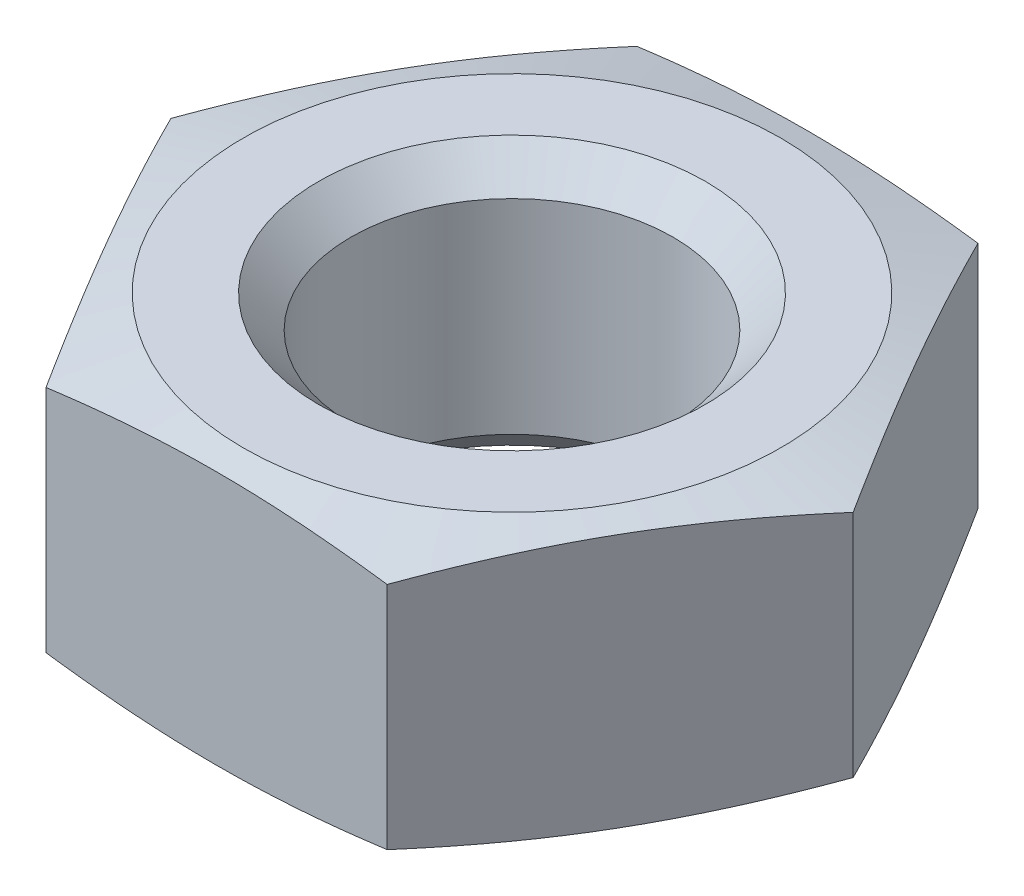
ISO-10303-21;
HEADER;
FILE_DESCRIPTION(('STEP AP214'),'2;1');
FILE_NAME('part.step','',(''),(''),'','','');
FILE_SCHEMA(('AUTOMOTIVE_DESIGN { 1 0 10303 214 1 1 1 1 }'));
ENDSEC;
DATA;
#1=APPLICATION_CONTEXT('core data for automotive mechanical design processes');
#2=APPLICATION_PROTOCOL_DEFINITION('international standard','automotive_design',2000,#1);
#3=PRODUCT_CONTEXT('',#1,'mechanical');
#4=PRODUCT('Part','Part','',(#3));
#5=PRODUCT_RELATED_PRODUCT_CATEGORY('part','',(#4));
#6=PRODUCT_DEFINITION_FORMATION('','',#4);
#7=PRODUCT_DEFINITION_CONTEXT('part definition',#1,'design');
#8=PRODUCT_DEFINITION('design','',#6,#7);
#9=PRODUCT_DEFINITION_SHAPE('','',#8);
#10=(LENGTH_UNIT() NAMED_UNIT(*) SI_UNIT(.MILLI.,.METRE.));
#11=(NAMED_UNIT(*) PLANE_ANGLE_UNIT() SI_UNIT($,.RADIAN.));
#12=(NAMED_UNIT(*) SI_UNIT($,.STERADIAN.) SOLID_ANGLE_UNIT());
#13=UNCERTAINTY_MEASURE_WITH_UNIT(LENGTH_MEASURE(1.E-05),#10,'distance_accuracy_value','');
#14=(GEOMETRIC_REPRESENTATION_CONTEXT(3) GLOBAL_UNCERTAINTY_ASSIGNED_CONTEXT((#13)) GLOBAL_UNIT_ASSIGNED_CONTEXT((#10,
#11,#12)) REPRESENTATION_CONTEXT('',''));
#15=CARTESIAN_POINT('',(0.,0.,0.));
#16=DIRECTION('',(0.,0.,1.));
#17=DIRECTION('',(1.,0.,0.));
#18=AXIS2_PLACEMENT_3D('',#15,#16,#17);
#19=CARTESIAN_POINT('',(-4.7631397208144,2.5,-2.75));
#20=DIRECTION('',(0.,-1.,0.));
#21=DIRECTION('',(0.,0.,-1.));
#22=AXIS2_PLACEMENT_3D('',#19,#20,#21);
#23=PLANE('',#22);
#24=CARTESIAN_POINT('',(0.,2.5,0.));
#25=DIRECTION('',(0.,-1.,0.));
#26=DIRECTION('',(0.,0.,-1.));
#27=AXIS2_PLACEMENT_3D('',#24,#25,#26);
#28=CIRCLE('',#27,2.5);
#29=CARTESIAN_POINT('',(0.,2.5,-2.5));
#30=VERTEX_POINT('',#29);
#31=EDGE_CURVE('E103',#30,#30,#28,.T.);
#32=ORIENTED_EDGE('',*,*,#31,.F.);
#33=EDGE_LOOP('',(#32));
#34=FACE_BOUND('',#33,.T.);
#35=CARTESIAN_POINT('',(0.,2.5,0.));
#36=DIRECTION('',(0.,-1.,0.));
#37=DIRECTION('',(0.,0.,-1.));
#38=AXIS2_PLACEMENT_3D('',#35,#36,#37);
#39=CIRCLE('',#38,1.8);
#40=CARTESIAN_POINT('',(0.,2.5,-1.8));
#41=VERTEX_POINT('',#40);
#42=EDGE_CURVE('E209',#41,#41,#39,.T.);
#43=ORIENTED_EDGE('',*,*,#42,.T.);
#44=EDGE_LOOP('',(#43));
#45=FACE_BOUND('',#44,.T.);
#46=ADVANCED_FACE('F30',(#34,#45),#23,.F.);
#47=CARTESIAN_POINT('',(-4.7631397208144,0.,-2.75));
#48=DIRECTION('',(0.,-1.,0.));
#49=DIRECTION('',(0.,0.,-1.));
#50=AXIS2_PLACEMENT_3D('',#47,#48,#49);
#51=PLANE('',#50);
#52=CARTESIAN_POINT('',(0.,0.,0.));
#53=DIRECTION('',(0.,-1.,0.));
#54=DIRECTION('',(0.,0.,-1.));
#55=AXIS2_PLACEMENT_3D('',#52,#53,#54);
#56=CIRCLE('',#55,2.5);
#57=CARTESIAN_POINT('',(0.,0.,-2.5));
#58=VERTEX_POINT('',#57);
#59=EDGE_CURVE('E191',#58,#58,#56,.T.);
#60=ORIENTED_EDGE('',*,*,#59,.T.);
#61=EDGE_LOOP('',(#60));
#62=FACE_BOUND('',#61,.T.);
#63=CARTESIAN_POINT('',(0.,0.,0.));
#64=DIRECTION('',(0.,-1.,0.));
#65=DIRECTION('',(0.,0.,-1.));
#66=AXIS2_PLACEMENT_3D('',#63,#64,#65);
#67=CIRCLE('',#66,1.8);
#68=CARTESIAN_POINT('',(0.,0.,-1.8));
#69=VERTEX_POINT('',#68);
#70=EDGE_CURVE('E203',#69,#69,#67,.T.);
#71=ORIENTED_EDGE('',*,*,#70,.F.);
#72=EDGE_LOOP('',(#71));
#73=FACE_BOUND('',#72,.T.);
#74=ADVANCED_FACE('F232',(#62,#73),#51,.T.);
#75=CARTESIAN_POINT('',(-1.58771324027146,2.5,2.75));
#76=DIRECTION('',(0.866025403784439,0.,-0.5));
#77=DIRECTION('',(-0.5,0.,-0.866025403784439));
#78=AXIS2_PLACEMENT_3D('',#75,#76,#77);
#79=PLANE('',#78);
#80=DIRECTION('',(0.,-1.,0.));
#81=VECTOR('',#80,1.);
#82=CARTESIAN_POINT('',(-1.58771324027146,2.5,2.75));
#83=LINE('',#82,#81);
#84=CARTESIAN_POINT('',(-1.58771324027149,2.31902001999193,2.75));
#85=VERTEX_POINT('',#84);
#86=CARTESIAN_POINT('',(-1.58771324027149,0.180979980008075,2.75));
#87=VERTEX_POINT('',#86);
#88=EDGE_CURVE('E117',#85,#87,#83,.T.);
#89=ORIENTED_EDGE('',*,*,#88,.F.);
#90=CARTESIAN_POINT('',(-1.58759777021762,2.31898907819667,2.7502));
#91=CARTESIAN_POINT('',(-1.65354106989093,2.33666714095726,2.63598285454709));
#92=CARTESIAN_POINT('',(-1.71960394358881,2.35271599027166,2.52155860080835));
#93=CARTESIAN_POINT('',(-1.85196302987708,2.38091241674241,2.29230593851367));
#94=CARTESIAN_POINT('',(-1.91825932624663,2.39305840879363,2.17747738484797));
#95=CARTESIAN_POINT('',(-2.05068324435206,2.41273995364582,1.94811243055202));
#96=CARTESIAN_POINT('',(-2.1168099703633,2.42029898080924,1.83357758136237));
#97=CARTESIAN_POINT('',(-2.24914776358957,2.43043487281712,1.60436179973292));
#98=CARTESIAN_POINT('',(-2.31535881199838,2.43301270189222,1.48968089986646));
#99=CARTESIAN_POINT('',(-2.447780908816,2.43301270189222,1.26031910013354));
#100=CARTESIAN_POINT('',(-2.51399195722481,2.43043487281712,1.14563820026708));
#101=CARTESIAN_POINT('',(-2.64632975045108,2.42029898080924,0.916422418637631));
#102=CARTESIAN_POINT('',(-2.71245647646232,2.41273995364582,0.801887569447985));
#103=CARTESIAN_POINT('',(-2.84488039456775,2.39305840879363,0.572522615152036));
#104=CARTESIAN_POINT('',(-2.9111766909373,2.38091241674242,0.457694061486333));
#105=CARTESIAN_POINT('',(-3.04353577722557,2.35271599027166,0.228441399191655));
#106=CARTESIAN_POINT('',(-3.10959865092346,2.33666714095727,0.114017145452912));
#107=CARTESIAN_POINT('',(-3.17554195059676,2.31898907819668,-0.000200000000000115));
#108=B_SPLINE_CURVE_WITH_KNOTS('',3,(#90,#91,#92,#93,#94,#95,#96,#97,#98,#99,#100,#101,#102,
#103,#104,#105,#106,#107),.UNSPECIFIED.,.F.,.F.,(4,2,2,2,2,2,2,2,4),(0.,0.399219246203696,
0.798600426844827,1.19592009799431,1.59316285066086,1.99040560332741,2.38772527447689,
2.78710645511802,3.18632570132172),.UNSPECIFIED.);
#109=CARTESIAN_POINT('',(-3.17542648054295,2.31902001999193,0.));
#110=VERTEX_POINT('',#109);
#111=EDGE_CURVE('E184',#85,#110,#108,.T.);
#112=ORIENTED_EDGE('',*,*,#111,.T.);
#113=DIRECTION('',(0.,-1.,0.));
#114=VECTOR('',#113,1.);
#115=CARTESIAN_POINT('',(-3.17542648054293,2.5,0.));
#116=LINE('',#115,#114);
#117=CARTESIAN_POINT('',(-3.17542648054293,0.180979980008068,0.));
#118=VERTEX_POINT('',#117);
#119=EDGE_CURVE('E58',#110,#118,#116,.T.);
#120=ORIENTED_EDGE('',*,*,#119,.T.);
#121=CARTESIAN_POINT('',(-3.17554195059676,0.181010921803324,-0.0002));
#122=CARTESIAN_POINT('',(-3.10959865092346,0.163332859042733,0.114017145452912));
#123=CARTESIAN_POINT('',(-3.04353577722557,0.147284009728339,0.228441399191655));
#124=CARTESIAN_POINT('',(-2.9111766909373,0.119087583257584,0.457694061486332));
#125=CARTESIAN_POINT('',(-2.84488039456775,0.106941591206373,0.572522615152036));
#126=CARTESIAN_POINT('',(-2.71245647646232,0.0872600463541762,0.801887569447985));
#127=CARTESIAN_POINT('',(-2.64632975045108,0.079701019190757,0.916422418637631));
#128=CARTESIAN_POINT('',(-2.51399195722481,0.0695651271828838,1.14563820026708));
#129=CARTESIAN_POINT('',(-2.447780908816,0.0669872981077755,1.26031910013354));
#130=CARTESIAN_POINT('',(-2.31535881199838,0.0669872981077757,1.48968089986646));
#131=CARTESIAN_POINT('',(-2.24914776358957,0.0695651271828842,1.60436179973292));
#132=CARTESIAN_POINT('',(-2.1168099703633,0.0797010191907579,1.83357758136237));
#133=CARTESIAN_POINT('',(-2.05068324435207,0.0872600463541773,1.94811243055202));
#134=CARTESIAN_POINT('',(-1.91825932624663,0.106941591206374,2.17747738484797));
#135=CARTESIAN_POINT('',(-1.85196302987708,0.119087583257586,2.29230593851367));
#136=CARTESIAN_POINT('',(-1.71960394358881,0.147284009728341,2.52155860080835));
#137=CARTESIAN_POINT('',(-1.65354106989093,0.163332859042736,2.63598285454709));
#138=CARTESIAN_POINT('',(-1.58759777021762,0.181010921803327,2.7502));
#139=B_SPLINE_CURVE_WITH_KNOTS('',3,(#121,#122,#123,#124,#125,#126,#127,#128,#129,#130,#131,
#132,#133,#134,#135,#136,#137,#138),.UNSPECIFIED.,.F.,.F.,(4,2,2,2,2,2,2,2,4),(0.,
0.399219246203695,0.798600426844827,1.19592009799431,1.59316285066086,1.99040560332741,
2.38772527447689,2.78710645511802,3.18632570132172),.UNSPECIFIED.);
#140=EDGE_CURVE('E164',#118,#87,#139,.T.);
#141=ORIENTED_EDGE('',*,*,#140,.T.);
#142=EDGE_LOOP('',(#89,#112,#120,#141));
#143=FACE_BOUND('',#142,.T.);
#144=ADVANCED_FACE('F32',(#143),#79,.F.);
#145=CARTESIAN_POINT('',(1.58771324027148,2.5,2.75));
#146=DIRECTION('',(0.,0.,-1.));
#147=DIRECTION('',(-1.,0.,0.));
#148=AXIS2_PLACEMENT_3D('',#145,#146,#147);
#149=PLANE('',#148);
#150=DIRECTION('',(0.,-1.,0.));
#151=VECTOR('',#150,1.);
#152=CARTESIAN_POINT('',(1.58771324027148,2.5,2.75));
#153=LINE('',#152,#151);
#154=CARTESIAN_POINT('',(1.58771324027148,2.31902001999193,2.75000000000001));
#155=VERTEX_POINT('',#154);
#156=CARTESIAN_POINT('',(1.58771324027148,0.180979980008075,2.75000000000001));
#157=VERTEX_POINT('',#156);
#158=EDGE_CURVE('E111',#155,#157,#153,.T.);
#159=ORIENTED_EDGE('',*,*,#158,.F.);
#160=CARTESIAN_POINT('',(-4.19285918867952,1.82631234693385,2.75));
#161=CARTESIAN_POINT('',(-4.06817976754613,1.85424041621434,2.75));
#162=CARTESIAN_POINT('',(-3.94342221565273,1.88182518986894,2.75));
#163=CARTESIAN_POINT('',(-3.69371236001423,1.9361241753599,2.75));
#164=CARTESIAN_POINT('',(-3.56876004805381,1.96283834937092,2.75));
#165=CARTESIAN_POINT('',(-3.31850931993245,2.01523560442669,2.75));
#166=CARTESIAN_POINT('',(-3.1932106837024,2.04091763969436,2.75));
#167=CARTESIAN_POINT('',(-2.94235251401161,2.09096704352158,2.75));
#168=CARTESIAN_POINT('',(-2.81679298277774,2.11533442325495,2.75));
#169=CARTESIAN_POINT('',(-2.44167593175011,2.18564686972704,2.75));
#170=CARTESIAN_POINT('',(-2.19166740134532,2.2292328242716,2.75));
#171=CARTESIAN_POINT('',(-1.69012485523942,2.30670928540745,2.75));
#172=CARTESIAN_POINT('',(-1.43859111787128,2.34060150966355,2.75));
#173=CARTESIAN_POINT('',(-1.05870556146362,2.38091530762415,2.75));
#174=CARTESIAN_POINT('',(-0.930918360489319,2.39263486510214,2.75));
#175=CARTESIAN_POINT('',(-0.675031046570547,2.41185169549126,2.75));
#176=CARTESIAN_POINT('',(-0.546930961319281,2.41934932938597,2.75));
#177=CARTESIAN_POINT('',(-0.290593162127314,2.42968744356361,2.75));
#178=CARTESIAN_POINT('',(-0.162355528269807,2.43252987249894,2.75));
#179=CARTESIAN_POINT('',(0.0941360386722519,2.43338217124408,2.75));
#180=CARTESIAN_POINT('',(0.222389971747281,2.43139204386425,2.75));
#181=CARTESIAN_POINT('',(0.479199851562949,2.42269155298056,2.75));
#182=CARTESIAN_POINT('',(0.607755209330919,2.41596411650578,2.75));
#183=CARTESIAN_POINT('',(0.864569604374925,2.3981708076519,2.75));
#184=CARTESIAN_POINT('',(0.992828614880219,2.38710455763722,2.75));
#185=CARTESIAN_POINT('',(1.37717143093041,2.34823790897467,2.75));
#186=CARTESIAN_POINT('',(1.63268120600845,2.31477548328654,2.75));
#187=CARTESIAN_POINT('',(2.12573879118887,2.24002742385407,2.75));
#188=CARTESIAN_POINT('',(2.36338872826613,2.19938025191619,2.75));
#189=CARTESIAN_POINT('',(2.83759965791816,2.11207208671604,2.75));
#190=CARTESIAN_POINT('',(3.07416050818193,2.06541032940346,2.75));
#191=CARTESIAN_POINT('',(3.54649047108779,1.9680569234665,2.75));
#192=CARTESIAN_POINT('',(3.78225941257475,1.91736445560768,2.75));
#193=CARTESIAN_POINT('',(4.25319147099222,1.81323223502391,2.75));
#194=CARTESIAN_POINT('',(4.48835457528013,1.75979242544746,2.75));
#195=CARTESIAN_POINT('',(4.9558916460958,1.65152769564751,2.75));
#196=CARTESIAN_POINT('',(5.18827005694075,1.59672188140533,2.75));
#197=CARTESIAN_POINT('',(5.65270347506399,1.48574143843594,2.75));
#198=CARTESIAN_POINT('',(5.88475847635984,1.42956678473407,2.75));
#199=CARTESIAN_POINT('',(6.34833499615551,1.31627647516695,2.75));
#200=CARTESIAN_POINT('',(6.57985681966117,1.25916206461808,2.75));
#201=CARTESIAN_POINT('',(7.04269925140169,1.14415550843018,2.75));
#202=CARTESIAN_POINT('',(7.27401986601836,1.0862633884927,2.75));
#203=CARTESIAN_POINT('',(7.50527038589639,1.02809584220951,2.75));
#204=B_SPLINE_CURVE_WITH_KNOTS('',3,(#160,#161,#162,#163,#164,#165,#166,#167,#168,#169,#170,
#171,#172,#173,#174,#175,#176,#177,#178,#179,#180,#181,#182,#183,#184,#185,#186,#187,#188,#189,
#190,#191,#192,#193,#194,#195,#196,#197,#198,#199,#200,#201,#202,#203),.UNSPECIFIED.,.F.,.F.,(4,
2,2,2,2,2,2,2,2,2,2,2,2,2,2,2,2,2,2,2,2,4),(0.,0.383308444677452,0.766633520987831,
1.15033766917444,1.53403855558364,2.29526757538086,3.05636162675387,3.44127372355814,
3.82615290454749,4.21087093525019,4.59558874222038,4.9817001919828,5.36784525503577,
6.14055444392882,6.86376465481048,7.58706682790123,8.31051638845151,9.0339809255719,
9.75023710852485,10.4665063694668,11.1818926966554,11.8972554397961),.UNSPECIFIED.);
#205=EDGE_CURVE('E177',#155,#85,#204,.F.);
#206=ORIENTED_EDGE('',*,*,#205,.T.);
#207=ORIENTED_EDGE('',*,*,#88,.T.);
#208=CARTESIAN_POINT('',(-4.19285918867952,0.673687653066146,2.75));
#209=CARTESIAN_POINT('',(-4.06817976754613,0.645759583785663,2.75));
#210=CARTESIAN_POINT('',(-3.94342221565272,0.618174810131057,2.75));
#211=CARTESIAN_POINT('',(-3.69371236001423,0.563875824640096,2.75));
#212=CARTESIAN_POINT('',(-3.56876004805381,0.537161650629077,2.75));
#213=CARTESIAN_POINT('',(-3.31850931993245,0.484764395573313,2.75));
#214=CARTESIAN_POINT('',(-3.1932106837024,0.459082360305643,2.75));
#215=CARTESIAN_POINT('',(-2.94235251401161,0.409032956478415,2.75));
#216=CARTESIAN_POINT('',(-2.81679298277774,0.384665576745046,2.75));
#217=CARTESIAN_POINT('',(-2.44167593175011,0.314353130272964,2.75));
#218=CARTESIAN_POINT('',(-2.19166740134532,0.270767175728396,2.75));
#219=CARTESIAN_POINT('',(-1.69012485523942,0.193290714592546,2.75));
#220=CARTESIAN_POINT('',(-1.43859111787128,0.159398490336447,2.75));
#221=CARTESIAN_POINT('',(-1.05870556146362,0.119084692375851,2.75));
#222=CARTESIAN_POINT('',(-0.930918360489319,0.107365134897856,2.75));
#223=CARTESIAN_POINT('',(-0.675031046570547,0.0881483045087401,2.75));
#224=CARTESIAN_POINT('',(-0.546930961319281,0.0806506706140325,2.75));
#225=CARTESIAN_POINT('',(-0.290593162127315,0.0703125564363945,2.75));
#226=CARTESIAN_POINT('',(-0.162355528269808,0.0674701275010565,2.75));
#227=CARTESIAN_POINT('',(0.0941360386722509,0.0666178287559217,2.75));
#228=CARTESIAN_POINT('',(0.22238997174728,0.0686079561357542,2.75));
#229=CARTESIAN_POINT('',(0.479199851562948,0.0773084470194415,2.75));
#230=CARTESIAN_POINT('',(0.607755209330918,0.0840358834942225,2.75));
#231=CARTESIAN_POINT('',(0.864569604374924,0.101829192348101,2.75));
#232=CARTESIAN_POINT('',(0.992828614880219,0.112895442362776,2.75));
#233=CARTESIAN_POINT('',(1.37717143093041,0.151762091025331,2.75));
#234=CARTESIAN_POINT('',(1.63268120600845,0.18522451671346,2.75));
#235=CARTESIAN_POINT('',(2.12573879118887,0.259972576145932,2.75));
#236=CARTESIAN_POINT('',(2.36338872826613,0.300619748083805,2.75));
#237=CARTESIAN_POINT('',(2.83759965791816,0.387927913283962,2.75));
#238=CARTESIAN_POINT('',(3.07416050818193,0.434589670596541,2.75));
#239=CARTESIAN_POINT('',(3.54649047108779,0.531943076533504,2.75));
#240=CARTESIAN_POINT('',(3.78225941257475,0.582635544392316,2.75));
#241=CARTESIAN_POINT('',(4.25319147099222,0.686767764976086,2.75));
#242=CARTESIAN_POINT('',(4.48835457528013,0.740207574552537,2.75));
#243=CARTESIAN_POINT('',(4.9558916460958,0.848472304352493,2.75));
#244=CARTESIAN_POINT('',(5.18827005694076,0.903278118594672,2.75));
#245=CARTESIAN_POINT('',(5.652703475064,1.01425856156406,2.75));
#246=CARTESIAN_POINT('',(5.88475847635984,1.07043321526593,2.75));
#247=CARTESIAN_POINT('',(6.34833499615551,1.18372352483305,2.75));
#248=CARTESIAN_POINT('',(6.57985681966118,1.24083793538192,2.75));
#249=CARTESIAN_POINT('',(7.04269925140169,1.35584449156982,2.75));
#250=CARTESIAN_POINT('',(7.27401986601836,1.4137366115073,2.75));
#251=CARTESIAN_POINT('',(7.50527038589639,1.47190415779049,2.75));
#252=B_SPLINE_CURVE_WITH_KNOTS('',3,(#208,#209,#210,#211,#212,#213,#214,#215,#216,#217,#218,
#219,#220,#221,#222,#223,#224,#225,#226,#227,#228,#229,#230,#231,#232,#233,#234,#235,#236,#237,
#238,#239,#240,#241,#242,#243,#244,#245,#246,#247,#248,#249,#250,#251),.UNSPECIFIED.,.F.,.F.,(4,
2,2,2,2,2,2,2,2,2,2,2,2,2,2,2,2,2,2,2,2,4),(0.,0.383308444677452,0.76663352098783,
1.15033766917444,1.53403855558364,2.29526757538086,3.05636162675387,3.44127372355814,
3.82615290454749,4.21087093525019,4.59558874222038,4.9817001919828,5.36784525503577,
6.14055444392882,6.86376465481048,7.58706682790123,8.31051638845151,9.0339809255719,
9.75023710852485,10.4665063694668,11.1818926966554,11.8972554397961),.UNSPECIFIED.);
#253=EDGE_CURVE('E159',#87,#157,#252,.T.);
#254=ORIENTED_EDGE('',*,*,#253,.T.);
#255=EDGE_LOOP('',(#159,#206,#207,#254));
#256=FACE_BOUND('',#255,.T.);
#257=ADVANCED_FACE('F169',(#256),#149,.F.);
#258=CARTESIAN_POINT('',(3.17542648054295,2.5,0.));
#259=DIRECTION('',(-0.866025403784439,0.,-0.5));
#260=DIRECTION('',(-0.5,0.,0.866025403784439));
#261=AXIS2_PLACEMENT_3D('',#258,#259,#260);
#262=PLANE('',#261);
#263=DIRECTION('',(0.,-1.,0.));
#264=VECTOR('',#263,1.);
#265=CARTESIAN_POINT('',(3.17542648054295,2.5,0.));
#266=LINE('',#265,#264);
#267=CARTESIAN_POINT('',(3.17542648054295,2.31902001999193,0.));
#268=VERTEX_POINT('',#267);
#269=CARTESIAN_POINT('',(3.17542648054295,0.180979980008075,0.));
#270=VERTEX_POINT('',#269);
#271=EDGE_CURVE('E109',#268,#270,#266,.T.);
#272=ORIENTED_EDGE('',*,*,#271,.F.);
#273=CARTESIAN_POINT('',(3.17554195059679,2.31898907819667,-0.000200000000000045));
#274=CARTESIAN_POINT('',(3.10959865092348,2.33666714095726,0.114017145452912));
#275=CARTESIAN_POINT('',(3.0435357772256,2.35271599027165,0.228441399191655));
#276=CARTESIAN_POINT('',(2.91117669093733,2.38091241674241,0.457694061486332));
#277=CARTESIAN_POINT('',(2.84488039456778,2.39305840879362,0.572522615152036));
#278=CARTESIAN_POINT('',(2.71245647646235,2.41273995364582,0.801887569447985));
#279=CARTESIAN_POINT('',(2.64632975045111,2.42029898080924,0.916422418637631));
#280=CARTESIAN_POINT('',(2.51399195722484,2.43043487281711,1.14563820026708));
#281=CARTESIAN_POINT('',(2.44778090881603,2.43301270189222,1.26031910013354));
#282=CARTESIAN_POINT('',(2.31535881199841,2.43301270189222,1.48968089986646));
#283=CARTESIAN_POINT('',(2.2491477635896,2.43043487281711,1.60436179973292));
#284=CARTESIAN_POINT('',(2.11680997036333,2.42029898080924,1.83357758136237));
#285=CARTESIAN_POINT('',(2.05068324435209,2.41273995364582,1.94811243055202));
#286=CARTESIAN_POINT('',(1.91825932624666,2.39305840879362,2.17747738484797));
#287=CARTESIAN_POINT('',(1.85196302987711,2.38091241674241,2.29230593851367));
#288=CARTESIAN_POINT('',(1.71960394358884,2.35271599027165,2.52155860080835));
#289=CARTESIAN_POINT('',(1.65354106989096,2.33666714095726,2.63598285454709));
#290=CARTESIAN_POINT('',(1.58759777021765,2.31898907819667,2.7502));
#291=B_SPLINE_CURVE_WITH_KNOTS('',3,(#273,#274,#275,#276,#277,#278,#279,#280,#281,#282,#283,
#284,#285,#286,#287,#288,#289,#290),.UNSPECIFIED.,.F.,.F.,(4,2,2,2,2,2,2,2,4),(0.,
0.399219246203696,0.798600426844827,1.19592009799431,1.59316285066086,1.99040560332741,
2.38772527447689,2.78710645511802,3.18632570132172),.UNSPECIFIED.);
#292=EDGE_CURVE('E91',#268,#155,#291,.T.);
#293=ORIENTED_EDGE('',*,*,#292,.T.);
#294=ORIENTED_EDGE('',*,*,#158,.T.);
#295=CARTESIAN_POINT('',(1.58759777021765,0.181010921803331,2.7502));
#296=CARTESIAN_POINT('',(1.65354106989096,0.16333285904274,2.63598285454709));
#297=CARTESIAN_POINT('',(1.71960394358884,0.147284009728346,2.52155860080835));
#298=CARTESIAN_POINT('',(1.85196302987711,0.119087583257591,2.29230593851367));
#299=CARTESIAN_POINT('',(1.91825932624666,0.106941591206379,2.17747738484797));
#300=CARTESIAN_POINT('',(2.05068324435209,0.0872600463541827,1.94811243055202));
#301=CARTESIAN_POINT('',(2.11680997036333,0.0797010191907635,1.83357758136237));
#302=CARTESIAN_POINT('',(2.2491477635896,0.0695651271828903,1.60436179973292));
#303=CARTESIAN_POINT('',(2.31535881199841,0.066987298107782,1.48968089986646));
#304=CARTESIAN_POINT('',(2.44778090881603,0.0669872981077821,1.26031910013354));
#305=CARTESIAN_POINT('',(2.51399195722484,0.0695651271828905,1.14563820026708));
#306=CARTESIAN_POINT('',(2.64632975045111,0.0797010191907639,0.916422418637631));
#307=CARTESIAN_POINT('',(2.71245647646235,0.0872600463541833,0.801887569447985));
#308=CARTESIAN_POINT('',(2.84488039456778,0.10694159120638,0.572522615152036));
#309=CARTESIAN_POINT('',(2.91117669093733,0.119087583257592,0.457694061486332));
#310=CARTESIAN_POINT('',(3.0435357772256,0.147284009728347,0.228441399191654));
#311=CARTESIAN_POINT('',(3.10959865092348,0.163332859042741,0.114017145452911));
#312=CARTESIAN_POINT('',(3.17554195059679,0.181010921803332,-0.000200000000000557));
#313=B_SPLINE_CURVE_WITH_KNOTS('',3,(#295,#296,#297,#298,#299,#300,#301,#302,#303,#304,#305,
#306,#307,#308,#309,#310,#311,#312),.UNSPECIFIED.,.F.,.F.,(4,2,2,2,2,2,2,2,4),(0.,
0.399219246203696,0.798600426844827,1.19592009799431,1.59316285066086,1.99040560332741,
2.38772527447689,2.78710645511802,3.18632570132172),.UNSPECIFIED.);
#314=EDGE_CURVE('E153',#157,#270,#313,.T.);
#315=ORIENTED_EDGE('',*,*,#314,.T.);
#316=EDGE_LOOP('',(#272,#293,#294,#315));
#317=FACE_BOUND('',#316,.T.);
#318=ADVANCED_FACE('F172',(#317),#262,.F.);
#319=CARTESIAN_POINT('',(1.58771324027148,2.5,-2.75));
#320=DIRECTION('',(-0.866025403784439,0.,0.5));
#321=DIRECTION('',(0.5,0.,0.866025403784439));
#322=AXIS2_PLACEMENT_3D('',#319,#320,#321);
#323=PLANE('',#322);
#324=DIRECTION('',(0.,-1.,0.));
#325=VECTOR('',#324,1.);
#326=CARTESIAN_POINT('',(1.58771324027148,2.5,-2.75));
#327=LINE('',#326,#325);
#328=CARTESIAN_POINT('',(1.58771324027149,2.31902001999193,-2.75));
#329=VERTEX_POINT('',#328);
#330=CARTESIAN_POINT('',(1.58771324027149,0.180979980008075,-2.75));
#331=VERTEX_POINT('',#330);
#332=EDGE_CURVE('E100',#329,#331,#327,.T.);
#333=ORIENTED_EDGE('',*,*,#332,.F.);
#334=CARTESIAN_POINT('',(1.58759777021765,2.31898907819667,-2.7502));
#335=CARTESIAN_POINT('',(1.65354106989096,2.33666714095726,-2.63598285454709));
#336=CARTESIAN_POINT('',(1.71960394358884,2.35271599027165,-2.52155860080835));
#337=CARTESIAN_POINT('',(1.85196302987711,2.38091241674241,-2.29230593851367));
#338=CARTESIAN_POINT('',(1.91825932624666,2.39305840879362,-2.17747738484797));
#339=CARTESIAN_POINT('',(2.05068324435209,2.41273995364582,-1.94811243055202));
#340=CARTESIAN_POINT('',(2.11680997036333,2.42029898080924,-1.83357758136237));
#341=CARTESIAN_POINT('',(2.2491477635896,2.43043487281711,-1.60436179973292));
#342=CARTESIAN_POINT('',(2.31535881199841,2.43301270189222,-1.48968089986646));
#343=CARTESIAN_POINT('',(2.44778090881603,2.43301270189222,-1.26031910013354));
#344=CARTESIAN_POINT('',(2.51399195722484,2.43043487281711,-1.14563820026708));
#345=CARTESIAN_POINT('',(2.64632975045111,2.42029898080924,-0.916422418637631));
#346=CARTESIAN_POINT('',(2.71245647646235,2.41273995364582,-0.801887569447985));
#347=CARTESIAN_POINT('',(2.84488039456778,2.39305840879362,-0.572522615152036));
#348=CARTESIAN_POINT('',(2.91117669093733,2.38091241674241,-0.457694061486332));
#349=CARTESIAN_POINT('',(3.0435357772256,2.35271599027165,-0.228441399191654));
#350=CARTESIAN_POINT('',(3.10959865092348,2.33666714095726,-0.114017145452911));
#351=CARTESIAN_POINT('',(3.17554195059679,2.31898907819667,0.00020000000000042));
#352=B_SPLINE_CURVE_WITH_KNOTS('',3,(#334,#335,#336,#337,#338,#339,#340,#341,#342,#343,#344,
#345,#346,#347,#348,#349,#350,#351),.UNSPECIFIED.,.F.,.F.,(4,2,2,2,2,2,2,2,4),(0.,
0.399219246203696,0.798600426844828,1.19592009799431,1.59316285066086,1.99040560332741,
2.38772527447689,2.78710645511802,3.18632570132172),.UNSPECIFIED.);
#353=EDGE_CURVE('E88',#329,#268,#352,.T.);
#354=ORIENTED_EDGE('',*,*,#353,.T.);
#355=ORIENTED_EDGE('',*,*,#271,.T.);
#356=CARTESIAN_POINT('',(3.17554195059679,0.181010921803332,0.0002));
#357=CARTESIAN_POINT('',(3.10959865092348,0.163332859042741,-0.114017145452912));
#358=CARTESIAN_POINT('',(3.0435357772256,0.147284009728347,-0.228441399191655));
#359=CARTESIAN_POINT('',(2.91117669093733,0.119087583257592,-0.457694061486332));
#360=CARTESIAN_POINT('',(2.84488039456778,0.10694159120638,-0.572522615152036));
#361=CARTESIAN_POINT('',(2.71245647646235,0.0872600463541833,-0.801887569447985));
#362=CARTESIAN_POINT('',(2.64632975045111,0.079701019190764,-0.916422418637631));
#363=CARTESIAN_POINT('',(2.51399195722484,0.0695651271828905,-1.14563820026708));
#364=CARTESIAN_POINT('',(2.44778090881603,0.066987298107782,-1.26031910013354));
#365=CARTESIAN_POINT('',(2.31535881199841,0.0669872981077819,-1.48968089986646));
#366=CARTESIAN_POINT('',(2.2491477635896,0.0695651271828902,-1.60436179973292));
#367=CARTESIAN_POINT('',(2.11680997036333,0.0797010191907635,-1.83357758136237));
#368=CARTESIAN_POINT('',(2.05068324435209,0.0872600463541827,-1.94811243055202));
#369=CARTESIAN_POINT('',(1.91825932624666,0.106941591206379,-2.17747738484797));
#370=CARTESIAN_POINT('',(1.85196302987711,0.119087583257591,-2.29230593851367));
#371=CARTESIAN_POINT('',(1.71960394358884,0.147284009728346,-2.52155860080835));
#372=CARTESIAN_POINT('',(1.65354106989096,0.16333285904274,-2.63598285454709));
#373=CARTESIAN_POINT('',(1.58759777021765,0.181010921803331,-2.7502));
#374=B_SPLINE_CURVE_WITH_KNOTS('',3,(#356,#357,#358,#359,#360,#361,#362,#363,#364,#365,#366,
#367,#368,#369,#370,#371,#372,#373),.UNSPECIFIED.,.F.,.F.,(4,2,2,2,2,2,2,2,4),(0.,
0.399219246203695,0.798600426844827,1.19592009799431,1.59316285066086,1.99040560332741,
2.38772527447689,2.78710645511802,3.18632570132172),.UNSPECIFIED.);
#375=EDGE_CURVE('E108',#270,#331,#374,.T.);
#376=ORIENTED_EDGE('',*,*,#375,.T.);
#377=EDGE_LOOP('',(#333,#354,#355,#376));
#378=FACE_BOUND('',#377,.T.);
#379=ADVANCED_FACE('F106',(#378),#323,.F.);
#380=CARTESIAN_POINT('',(-1.58771324027146,2.5,-2.75));
#381=DIRECTION('',(0.,0.,1.));
#382=DIRECTION('',(1.,0.,0.));
#383=AXIS2_PLACEMENT_3D('',#380,#381,#382);
#384=PLANE('',#383);
#385=DIRECTION('',(0.,-1.,0.));
#386=VECTOR('',#385,1.);
#387=CARTESIAN_POINT('',(-1.58771324027146,2.5,-2.75));
#388=LINE('',#387,#386);
#389=CARTESIAN_POINT('',(-1.58771324027146,2.31902001999193,-2.75));
#390=VERTEX_POINT('',#389);
#391=CARTESIAN_POINT('',(-1.58771324027144,0.180979980008075,-2.75000000000003));
#392=VERTEX_POINT('',#391);
#393=EDGE_CURVE('E102',#390,#392,#388,.T.);
#394=ORIENTED_EDGE('',*,*,#393,.F.);
#395=CARTESIAN_POINT('',(-4.19285918867952,1.82631234693385,-2.75));
#396=CARTESIAN_POINT('',(-4.06817976754613,1.85424041621434,-2.75));
#397=CARTESIAN_POINT('',(-3.94342221565273,1.88182518986894,-2.75));
#398=CARTESIAN_POINT('',(-3.69371236001423,1.9361241753599,-2.75));
#399=CARTESIAN_POINT('',(-3.56876004805381,1.96283834937092,-2.75));
#400=CARTESIAN_POINT('',(-3.31850931993245,2.01523560442669,-2.75));
#401=CARTESIAN_POINT('',(-3.1932106837024,2.04091763969436,-2.75));
#402=CARTESIAN_POINT('',(-2.94235251401161,2.09096704352158,-2.75));
#403=CARTESIAN_POINT('',(-2.81679298277774,2.11533442325495,-2.75));
#404=CARTESIAN_POINT('',(-2.44167593175011,2.18564686972704,-2.75));
#405=CARTESIAN_POINT('',(-2.19166740134532,2.2292328242716,-2.75));
#406=CARTESIAN_POINT('',(-1.69012485523942,2.30670928540745,-2.75));
#407=CARTESIAN_POINT('',(-1.43859111787128,2.34060150966355,-2.75));
#408=CARTESIAN_POINT('',(-1.05870556146362,2.38091530762415,-2.75));
#409=CARTESIAN_POINT('',(-0.930918360489319,2.39263486510214,-2.75));
#410=CARTESIAN_POINT('',(-0.675031046570547,2.41185169549126,-2.75));
#411=CARTESIAN_POINT('',(-0.546930961319281,2.41934932938597,-2.75));
#412=CARTESIAN_POINT('',(-0.290593162127314,2.42968744356361,-2.75));
#413=CARTESIAN_POINT('',(-0.162355528269807,2.43252987249894,-2.75));
#414=CARTESIAN_POINT('',(0.0941360386722519,2.43338217124408,-2.75));
#415=CARTESIAN_POINT('',(0.222389971747281,2.43139204386425,-2.75));
#416=CARTESIAN_POINT('',(0.479199851562949,2.42269155298056,-2.75));
#417=CARTESIAN_POINT('',(0.607755209330919,2.41596411650578,-2.75));
#418=CARTESIAN_POINT('',(0.864569604374925,2.3981708076519,-2.75));
#419=CARTESIAN_POINT('',(0.992828614880219,2.38710455763722,-2.75));
#420=CARTESIAN_POINT('',(1.37717143093041,2.34823790897467,-2.75));
#421=CARTESIAN_POINT('',(1.63268120600845,2.31477548328654,-2.75));
#422=CARTESIAN_POINT('',(2.12573879118887,2.24002742385407,-2.75));
#423=CARTESIAN_POINT('',(2.36338872826613,2.19938025191619,-2.75));
#424=CARTESIAN_POINT('',(2.83759965791816,2.11207208671604,-2.75));
#425=CARTESIAN_POINT('',(3.07416050818193,2.06541032940346,-2.75));
#426=CARTESIAN_POINT('',(3.54649047108779,1.9680569234665,-2.75));
#427=CARTESIAN_POINT('',(3.78225941257475,1.91736445560768,-2.75));
#428=CARTESIAN_POINT('',(4.25319147099222,1.81323223502391,-2.75));
#429=CARTESIAN_POINT('',(4.48835457528013,1.75979242544746,-2.75));
#430=CARTESIAN_POINT('',(4.9558916460958,1.65152769564751,-2.75));
#431=CARTESIAN_POINT('',(5.18827005694075,1.59672188140533,-2.75));
#432=CARTESIAN_POINT('',(5.65270347506399,1.48574143843594,-2.75));
#433=CARTESIAN_POINT('',(5.88475847635984,1.42956678473407,-2.75));
#434=CARTESIAN_POINT('',(6.34833499615551,1.31627647516695,-2.75));
#435=CARTESIAN_POINT('',(6.57985681966117,1.25916206461808,-2.75));
#436=CARTESIAN_POINT('',(7.04269925140169,1.14415550843018,-2.75));
#437=CARTESIAN_POINT('',(7.27401986601836,1.0862633884927,-2.75));
#438=CARTESIAN_POINT('',(7.50527038589639,1.02809584220951,-2.75));
#439=B_SPLINE_CURVE_WITH_KNOTS('',3,(#395,#396,#397,#398,#399,#400,#401,#402,#403,#404,#405,
#406,#407,#408,#409,#410,#411,#412,#413,#414,#415,#416,#417,#418,#419,#420,#421,#422,#423,#424,
#425,#426,#427,#428,#429,#430,#431,#432,#433,#434,#435,#436,#437,#438),.UNSPECIFIED.,.F.,.F.,(4,
2,2,2,2,2,2,2,2,2,2,2,2,2,2,2,2,2,2,2,2,4),(0.,0.383308444677452,0.766633520987831,
1.15033766917444,1.53403855558364,2.29526757538086,3.05636162675387,3.44127372355814,
3.82615290454749,4.21087093525019,4.59558874222038,4.9817001919828,5.36784525503577,
6.14055444392882,6.86376465481048,7.58706682790123,8.31051638845151,9.0339809255719,
9.75023710852485,10.4665063694668,11.1818926966554,11.8972554397961),.UNSPECIFIED.);
#440=EDGE_CURVE('E51',#390,#329,#439,.T.);
#441=ORIENTED_EDGE('',*,*,#440,.T.);
#442=ORIENTED_EDGE('',*,*,#332,.T.);
#443=CARTESIAN_POINT('',(-4.19285918867952,0.673687653066146,-2.75));
#444=CARTESIAN_POINT('',(-4.06817976754613,0.645759583785663,-2.75));
#445=CARTESIAN_POINT('',(-3.94342221565272,0.618174810131057,-2.75));
#446=CARTESIAN_POINT('',(-3.69371236001423,0.563875824640096,-2.75));
#447=CARTESIAN_POINT('',(-3.56876004805381,0.537161650629077,-2.75));
#448=CARTESIAN_POINT('',(-3.31850931993245,0.484764395573313,-2.75));
#449=CARTESIAN_POINT('',(-3.1932106837024,0.459082360305643,-2.75));
#450=CARTESIAN_POINT('',(-2.94235251401161,0.409032956478415,-2.75));
#451=CARTESIAN_POINT('',(-2.81679298277774,0.384665576745046,-2.75));
#452=CARTESIAN_POINT('',(-2.44167593175011,0.314353130272964,-2.75));
#453=CARTESIAN_POINT('',(-2.19166740134532,0.270767175728396,-2.75));
#454=CARTESIAN_POINT('',(-1.69012485523942,0.193290714592546,-2.75));
#455=CARTESIAN_POINT('',(-1.43859111787128,0.159398490336447,-2.75));
#456=CARTESIAN_POINT('',(-1.05870556146362,0.119084692375851,-2.75));
#457=CARTESIAN_POINT('',(-0.930918360489319,0.107365134897856,-2.75));
#458=CARTESIAN_POINT('',(-0.675031046570547,0.0881483045087401,-2.75));
#459=CARTESIAN_POINT('',(-0.546930961319281,0.0806506706140325,-2.75));
#460=CARTESIAN_POINT('',(-0.290593162127315,0.0703125564363945,-2.75));
#461=CARTESIAN_POINT('',(-0.162355528269808,0.0674701275010565,-2.75));
#462=CARTESIAN_POINT('',(0.0941360386722509,0.0666178287559217,-2.75));
#463=CARTESIAN_POINT('',(0.22238997174728,0.0686079561357542,-2.75));
#464=CARTESIAN_POINT('',(0.479199851562948,0.0773084470194415,-2.75));
#465=CARTESIAN_POINT('',(0.607755209330918,0.0840358834942225,-2.75));
#466=CARTESIAN_POINT('',(0.864569604374924,0.101829192348101,-2.75));
#467=CARTESIAN_POINT('',(0.992828614880219,0.112895442362776,-2.75));
#468=CARTESIAN_POINT('',(1.37717143093041,0.151762091025331,-2.75));
#469=CARTESIAN_POINT('',(1.63268120600845,0.18522451671346,-2.75));
#470=CARTESIAN_POINT('',(2.12573879118887,0.259972576145932,-2.75));
#471=CARTESIAN_POINT('',(2.36338872826613,0.300619748083805,-2.75));
#472=CARTESIAN_POINT('',(2.83759965791816,0.387927913283962,-2.75));
#473=CARTESIAN_POINT('',(3.07416050818193,0.434589670596541,-2.75));
#474=CARTESIAN_POINT('',(3.54649047108779,0.531943076533504,-2.75));
#475=CARTESIAN_POINT('',(3.78225941257475,0.582635544392316,-2.75));
#476=CARTESIAN_POINT('',(4.25319147099222,0.686767764976086,-2.75));
#477=CARTESIAN_POINT('',(4.48835457528013,0.740207574552537,-2.75));
#478=CARTESIAN_POINT('',(4.9558916460958,0.848472304352493,-2.75));
#479=CARTESIAN_POINT('',(5.18827005694076,0.903278118594672,-2.75));
#480=CARTESIAN_POINT('',(5.652703475064,1.01425856156406,-2.75));
#481=CARTESIAN_POINT('',(5.88475847635984,1.07043321526593,-2.75));
#482=CARTESIAN_POINT('',(6.34833499615551,1.18372352483305,-2.75));
#483=CARTESIAN_POINT('',(6.57985681966118,1.24083793538192,-2.75));
#484=CARTESIAN_POINT('',(7.04269925140169,1.35584449156982,-2.75));
#485=CARTESIAN_POINT('',(7.27401986601836,1.4137366115073,-2.75));
#486=CARTESIAN_POINT('',(7.50527038589639,1.47190415779049,-2.75));
#487=B_SPLINE_CURVE_WITH_KNOTS('',3,(#443,#444,#445,#446,#447,#448,#449,#450,#451,#452,#453,
#454,#455,#456,#457,#458,#459,#460,#461,#462,#463,#464,#465,#466,#467,#468,#469,#470,#471,#472,
#473,#474,#475,#476,#477,#478,#479,#480,#481,#482,#483,#484,#485,#486),.UNSPECIFIED.,.F.,.F.,(4,
2,2,2,2,2,2,2,2,2,2,2,2,2,2,2,2,2,2,2,2,4),(0.,0.383308444677452,0.76663352098783,
1.15033766917444,1.53403855558364,2.29526757538086,3.05636162675387,3.44127372355814,
3.82615290454749,4.21087093525019,4.59558874222038,4.9817001919828,5.36784525503577,
6.14055444392882,6.86376465481048,7.58706682790123,8.31051638845151,9.0339809255719,
9.75023710852485,10.4665063694668,11.1818926966554,11.8972554397961),.UNSPECIFIED.);
#488=EDGE_CURVE('E141',#331,#392,#487,.F.);
#489=ORIENTED_EDGE('',*,*,#488,.T.);
#490=EDGE_LOOP('',(#394,#441,#442,#489));
#491=FACE_BOUND('',#490,.T.);
#492=ADVANCED_FACE('F98',(#491),#384,.F.);
#493=CARTESIAN_POINT('',(-3.17542648054293,2.5,0.));
#494=DIRECTION('',(0.866025403784439,0.,0.5));
#495=DIRECTION('',(0.5,0.,-0.866025403784439));
#496=AXIS2_PLACEMENT_3D('',#493,#494,#495);
#497=PLANE('',#496);
#498=ORIENTED_EDGE('',*,*,#119,.F.);
#499=CARTESIAN_POINT('',(-3.17554195059676,2.31898907819668,0.000200000000000051));
#500=CARTESIAN_POINT('',(-3.10959865092346,2.33666714095727,-0.114017145452912));
#501=CARTESIAN_POINT('',(-3.04353577722557,2.35271599027166,-0.228441399191655));
#502=CARTESIAN_POINT('',(-2.9111766909373,2.38091241674242,-0.457694061486332));
#503=CARTESIAN_POINT('',(-2.84488039456775,2.39305840879363,-0.572522615152036));
#504=CARTESIAN_POINT('',(-2.71245647646232,2.41273995364582,-0.801887569447986));
#505=CARTESIAN_POINT('',(-2.64632975045108,2.42029898080924,-0.916422418637632));
#506=CARTESIAN_POINT('',(-2.51399195722481,2.43043487281712,-1.14563820026708));
#507=CARTESIAN_POINT('',(-2.447780908816,2.43301270189222,-1.26031910013354));
#508=CARTESIAN_POINT('',(-2.31535881199838,2.43301270189222,-1.48968089986646));
#509=CARTESIAN_POINT('',(-2.24914776358957,2.43043487281712,-1.60436179973292));
#510=CARTESIAN_POINT('',(-2.1168099703633,2.42029898080924,-1.83357758136237));
#511=CARTESIAN_POINT('',(-2.05068324435207,2.41273995364582,-1.94811243055202));
#512=CARTESIAN_POINT('',(-1.91825932624663,2.39305840879363,-2.17747738484797));
#513=CARTESIAN_POINT('',(-1.85196302987708,2.38091241674241,-2.29230593851367));
#514=CARTESIAN_POINT('',(-1.71960394358881,2.35271599027166,-2.52155860080835));
#515=CARTESIAN_POINT('',(-1.65354106989093,2.33666714095726,-2.63598285454709));
#516=CARTESIAN_POINT('',(-1.58759777021762,2.31898907819667,-2.7502));
#517=B_SPLINE_CURVE_WITH_KNOTS('',3,(#499,#500,#501,#502,#503,#504,#505,#506,#507,#508,#509,
#510,#511,#512,#513,#514,#515,#516),.UNSPECIFIED.,.F.,.F.,(4,2,2,2,2,2,2,2,4),(0.,
0.399219246203696,0.798600426844827,1.19592009799431,1.59316285066086,1.99040560332741,
2.38772527447689,2.78710645511802,3.18632570132172),.UNSPECIFIED.);
#518=EDGE_CURVE('E11',#110,#390,#517,.T.);
#519=ORIENTED_EDGE('',*,*,#518,.T.);
#520=ORIENTED_EDGE('',*,*,#393,.T.);
#521=CARTESIAN_POINT('',(-1.58759777021762,0.181010921803327,-2.7502));
#522=CARTESIAN_POINT('',(-1.65354106989093,0.163332859042736,-2.63598285454709));
#523=CARTESIAN_POINT('',(-1.71960394358881,0.147284009728342,-2.52155860080835));
#524=CARTESIAN_POINT('',(-1.85196302987708,0.119087583257586,-2.29230593851367));
#525=CARTESIAN_POINT('',(-1.91825932624663,0.106941591206374,-2.17747738484797));
#526=CARTESIAN_POINT('',(-2.05068324435207,0.0872600463541773,-1.94811243055202));
#527=CARTESIAN_POINT('',(-2.1168099703633,0.0797010191907579,-1.83357758136237));
#528=CARTESIAN_POINT('',(-2.24914776358957,0.0695651271828842,-1.60436179973292));
#529=CARTESIAN_POINT('',(-2.31535881199838,0.0669872981077758,-1.48968089986646));
#530=CARTESIAN_POINT('',(-2.447780908816,0.0669872981077755,-1.26031910013354));
#531=CARTESIAN_POINT('',(-2.51399195722481,0.0695651271828837,-1.14563820026708));
#532=CARTESIAN_POINT('',(-2.64632975045108,0.0797010191907568,-0.916422418637632));
#533=CARTESIAN_POINT('',(-2.71245647646232,0.0872600463541761,-0.801887569447985));
#534=CARTESIAN_POINT('',(-2.84488039456775,0.106941591206373,-0.572522615152036));
#535=CARTESIAN_POINT('',(-2.9111766909373,0.119087583257584,-0.457694061486333));
#536=CARTESIAN_POINT('',(-3.04353577722557,0.147284009728339,-0.228441399191655));
#537=CARTESIAN_POINT('',(-3.10959865092346,0.163332859042733,-0.114017145452912));
#538=CARTESIAN_POINT('',(-3.17554195059676,0.181010921803324,0.000200000000000072));
#539=B_SPLINE_CURVE_WITH_KNOTS('',3,(#521,#522,#523,#524,#525,#526,#527,#528,#529,#530,#531,
#532,#533,#534,#535,#536,#537,#538),.UNSPECIFIED.,.F.,.F.,(4,2,2,2,2,2,2,2,4),(0.,
0.399219246203695,0.798600426844827,1.19592009799431,1.59316285066086,1.99040560332741,
2.38772527447689,2.78710645511802,3.18632570132172),.UNSPECIFIED.);
#540=EDGE_CURVE('E44',#392,#118,#539,.T.);
#541=ORIENTED_EDGE('',*,*,#540,.T.);
#542=EDGE_LOOP('',(#498,#519,#520,#541));
#543=FACE_BOUND('',#542,.T.);
#544=ADVANCED_FACE('F123',(#543),#497,.F.);
#545=CARTESIAN_POINT('',(0.,2.5,0.));
#546=DIRECTION('',(0.,-1.,0.));
#547=DIRECTION('',(0.,0.,-1.));
#548=AXIS2_PLACEMENT_3D('',#545,#546,#547);
#549=CYLINDRICAL_SURFACE('',#548,1.5);
#550=CARTESIAN_POINT('',(0.,0.3,0.));
#551=DIRECTION('',(0.,-1.,0.));
#552=DIRECTION('',(0.,0.,-1.));
#553=AXIS2_PLACEMENT_3D('',#550,#551,#552);
#554=CIRCLE('',#553,1.5);
#555=CARTESIAN_POINT('',(0.,0.3,-1.5));
#556=VERTEX_POINT('',#555);
#557=EDGE_CURVE('E205',#556,#556,#554,.T.);
#558=ORIENTED_EDGE('',*,*,#557,.T.);
#559=EDGE_LOOP('',(#558));
#560=FACE_BOUND('',#559,.T.);
#561=CARTESIAN_POINT('',(0.,2.2,0.));
#562=DIRECTION('',(0.,-1.,0.));
#563=DIRECTION('',(0.,0.,-1.));
#564=AXIS2_PLACEMENT_3D('',#561,#562,#563);
#565=CIRCLE('',#564,1.5);
#566=CARTESIAN_POINT('',(0.,2.2,-1.5));
#567=VERTEX_POINT('',#566);
#568=EDGE_CURVE('E214',#567,#567,#565,.T.);
#569=ORIENTED_EDGE('',*,*,#568,.F.);
#570=EDGE_LOOP('',(#569));
#571=FACE_BOUND('',#570,.T.);
#572=ADVANCED_FACE('F220',(#560,#571),#549,.F.);
#573=CARTESIAN_POINT('',(0.,2.2,0.));
#574=DIRECTION('',(0.,1.,0.));
#575=DIRECTION('',(0.,0.,1.));
#576=AXIS2_PLACEMENT_3D('',#573,#574,#575);
#577=CONICAL_SURFACE('',#576,1.5,0.785398163397448);
#578=ORIENTED_EDGE('',*,*,#42,.F.);
#579=EDGE_LOOP('',(#578));
#580=FACE_BOUND('',#579,.T.);
#581=ORIENTED_EDGE('',*,*,#568,.T.);
#582=EDGE_LOOP('',(#581));
#583=FACE_BOUND('',#582,.T.);
#584=ADVANCED_FACE('F218',(#580,#583),#577,.F.);
#585=CARTESIAN_POINT('',(0.,0.,0.));
#586=DIRECTION('',(0.,-1.,0.));
#587=DIRECTION('',(0.,0.,-1.));
#588=AXIS2_PLACEMENT_3D('',#585,#586,#587);
#589=CONICAL_SURFACE('',#588,1.8,0.785398163397448);
#590=ORIENTED_EDGE('',*,*,#557,.F.);
#591=EDGE_LOOP('',(#590));
#592=FACE_BOUND('',#591,.T.);
#593=ORIENTED_EDGE('',*,*,#70,.T.);
#594=EDGE_LOOP('',(#593));
#595=FACE_BOUND('',#594,.T.);
#596=ADVANCED_FACE('F131',(#592,#595),#589,.F.);
#597=CARTESIAN_POINT('',(0.,0.180979980008075,0.));
#598=DIRECTION('',(0.,1.,0.));
#599=DIRECTION('',(0.,0.,1.));
#600=AXIS2_PLACEMENT_3D('',#597,#598,#599);
#601=CONICAL_SURFACE('',#600,3.17542648054295,1.30899693899575);
#602=ORIENTED_EDGE('',*,*,#59,.F.);
#603=EDGE_LOOP('',(#602));
#604=FACE_BOUND('',#603,.T.);
#605=ORIENTED_EDGE('',*,*,#540,.F.);
#606=ORIENTED_EDGE('',*,*,#488,.F.);
#607=ORIENTED_EDGE('',*,*,#375,.F.);
#608=ORIENTED_EDGE('',*,*,#314,.F.);
#609=ORIENTED_EDGE('',*,*,#253,.F.);
#610=ORIENTED_EDGE('',*,*,#140,.F.);
#611=EDGE_LOOP('',(#605,#606,#607,#608,#609,#610));
#612=FACE_BOUND('',#611,.T.);
#613=ADVANCED_FACE('F127',(#604,#612),#601,.T.);
#614=CARTESIAN_POINT('',(0.,2.5,0.));
#615=DIRECTION('',(0.,-1.,0.));
#616=DIRECTION('',(0.,0.,-1.));
#617=AXIS2_PLACEMENT_3D('',#614,#615,#616);
#618=CONICAL_SURFACE('',#617,2.5,1.30899693899575);
#619=ORIENTED_EDGE('',*,*,#31,.T.);
#620=EDGE_LOOP('',(#619));
#621=FACE_BOUND('',#620,.T.);
#622=ORIENTED_EDGE('',*,*,#205,.F.);
#623=ORIENTED_EDGE('',*,*,#292,.F.);
#624=ORIENTED_EDGE('',*,*,#353,.F.);
#625=ORIENTED_EDGE('',*,*,#440,.F.);
#626=ORIENTED_EDGE('',*,*,#518,.F.);
#627=ORIENTED_EDGE('',*,*,#111,.F.);
#628=EDGE_LOOP('',(#622,#623,#624,#625,#626,#627));
#629=FACE_BOUND('',#628,.T.);
#630=ADVANCED_FACE('F89',(#621,#629),#618,.T.);
#631=CLOSED_SHELL('',(#46,#74,#144,#257,#318,#379,#492,#544,#572,#584,#596,#613,#630));
#632=MANIFOLD_SOLID_BREP('B2',#631);
#633=ADVANCED_BREP_SHAPE_REPRESENTATION('',(#18,#632),#14);
#634=SHAPE_DEFINITION_REPRESENTATION(#9,#633);
ENDSEC;
END-ISO-10303-21;
